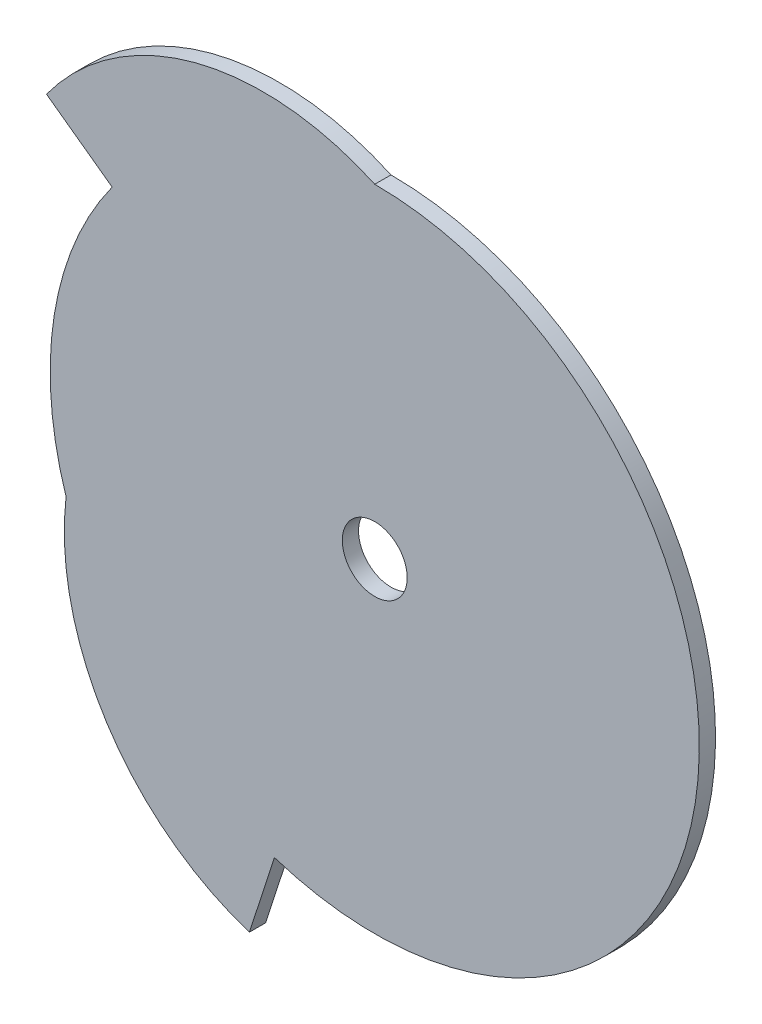
ISO-10303-21;
HEADER;
FILE_DESCRIPTION(('STEP AP214'),'2;1');
FILE_NAME('part.step','',(''),(''),'','','');
FILE_SCHEMA(('AUTOMOTIVE_DESIGN { 1 0 10303 214 1 1 1 1 }'));
ENDSEC;
DATA;
#1=APPLICATION_CONTEXT('core data for automotive mechanical design processes');
#2=APPLICATION_PROTOCOL_DEFINITION('international standard','automotive_design',2000,#1);
#3=PRODUCT_CONTEXT('',#1,'mechanical');
#4=PRODUCT('Part','Part','',(#3));
#5=PRODUCT_RELATED_PRODUCT_CATEGORY('part','',(#4));
#6=PRODUCT_DEFINITION_FORMATION('','',#4);
#7=PRODUCT_DEFINITION_CONTEXT('part definition',#1,'design');
#8=PRODUCT_DEFINITION('design','',#6,#7);
#9=PRODUCT_DEFINITION_SHAPE('','',#8);
#10=(LENGTH_UNIT() NAMED_UNIT(*) SI_UNIT(.MILLI.,.METRE.));
#11=(NAMED_UNIT(*) PLANE_ANGLE_UNIT() SI_UNIT($,.RADIAN.));
#12=(NAMED_UNIT(*) SI_UNIT($,.STERADIAN.) SOLID_ANGLE_UNIT());
#13=UNCERTAINTY_MEASURE_WITH_UNIT(LENGTH_MEASURE(1.E-05),#10,'distance_accuracy_value','');
#14=(GEOMETRIC_REPRESENTATION_CONTEXT(3) GLOBAL_UNCERTAINTY_ASSIGNED_CONTEXT((#13)) GLOBAL_UNIT_ASSIGNED_CONTEXT((#10,
#11,#12)) REPRESENTATION_CONTEXT('',''));
#15=CARTESIAN_POINT('',(0.,0.,0.));
#16=DIRECTION('',(0.,0.,1.));
#17=DIRECTION('',(1.,0.,0.));
#18=AXIS2_PLACEMENT_3D('',#15,#16,#17);
#19=CARTESIAN_POINT('',(0.,0.,3.));
#20=DIRECTION('',(0.,0.,-1.));
#21=DIRECTION('',(-1.,0.,0.));
#22=AXIS2_PLACEMENT_3D('',#19,#20,#21);
#23=CYLINDRICAL_SURFACE('',#22,60.);
#24=CARTESIAN_POINT('',(0.,0.,0.));
#25=DIRECTION('',(0.,0.,1.));
#26=DIRECTION('',(1.,0.,0.));
#27=AXIS2_PLACEMENT_3D('',#24,#25,#26);
#28=CIRCLE('',#27,60.);
#29=CARTESIAN_POINT('',(-48.5410196624971,35.2671151375481,0.));
#30=VERTEX_POINT('',#29);
#31=CARTESIAN_POINT('',(-57.0633909777091,-18.5410196624971,0.));
#32=VERTEX_POINT('',#31);
#33=EDGE_CURVE('E128',#30,#32,#28,.T.);
#34=ORIENTED_EDGE('',*,*,#33,.T.);
#35=DIRECTION('',(0.,0.,-1.));
#36=VECTOR('',#35,1.);
#37=CARTESIAN_POINT('',(-57.0633909777091,-18.5410196624971,3.));
#38=LINE('',#37,#36);
#39=CARTESIAN_POINT('',(-57.0633909777091,-18.5410196624971,3.));
#40=VERTEX_POINT('',#39);
#41=EDGE_CURVE('E11',#40,#32,#38,.T.);
#42=ORIENTED_EDGE('',*,*,#41,.F.);
#43=CARTESIAN_POINT('',(0.,0.,3.));
#44=DIRECTION('',(0.,0.,1.));
#45=DIRECTION('',(1.,0.,0.));
#46=AXIS2_PLACEMENT_3D('',#43,#44,#45);
#47=CIRCLE('',#46,60.);
#48=CARTESIAN_POINT('',(-48.5410196624971,35.2671151375481,3.));
#49=VERTEX_POINT('',#48);
#50=EDGE_CURVE('E145',#49,#40,#47,.T.);
#51=ORIENTED_EDGE('',*,*,#50,.F.);
#52=DIRECTION('',(0.,0.,-1.));
#53=VECTOR('',#52,1.);
#54=CARTESIAN_POINT('',(-48.5410196624971,35.2671151375481,3.));
#55=LINE('',#54,#53);
#56=EDGE_CURVE('E124',#49,#30,#55,.T.);
#57=ORIENTED_EDGE('',*,*,#56,.T.);
#58=EDGE_LOOP('',(#34,#42,#51,#57));
#59=FACE_BOUND('',#58,.T.);
#60=ADVANCED_FACE('F39',(#59),#23,.T.);
#61=CARTESIAN_POINT('',(-7.87457814572885,-24.2354595213106,3.));
#62=DIRECTION('',(0.,0.,-1.));
#63=DIRECTION('',(-1.,0.,0.));
#64=AXIS2_PLACEMENT_3D('',#61,#62,#63);
#65=CYLINDRICAL_SURFACE('',#64,49.5173298262864);
#66=CARTESIAN_POINT('',(-7.87457814572885,-24.2354595213106,0.));
#67=DIRECTION('',(0.,0.,1.));
#68=DIRECTION('',(-1.,0.,0.));
#69=AXIS2_PLACEMENT_3D('',#66,#67,#68);
#70=CIRCLE('',#69,49.5173298262864);
#71=CARTESIAN_POINT('',(-23.1762745781203,-71.3292387221368,0.));
#72=VERTEX_POINT('',#71);
#73=EDGE_CURVE('E132',#32,#72,#70,.T.);
#74=ORIENTED_EDGE('',*,*,#73,.T.);
#75=DIRECTION('',(0.,0.,-1.));
#76=VECTOR('',#75,1.);
#77=CARTESIAN_POINT('',(-23.1762745781203,-71.3292387221368,3.));
#78=LINE('',#77,#76);
#79=CARTESIAN_POINT('',(-23.1762745781203,-71.3292387221368,3.));
#80=VERTEX_POINT('',#79);
#81=EDGE_CURVE('E48',#80,#72,#78,.T.);
#82=ORIENTED_EDGE('',*,*,#81,.F.);
#83=CARTESIAN_POINT('',(-7.87457814572885,-24.2354595213106,3.));
#84=DIRECTION('',(0.,0.,1.));
#85=DIRECTION('',(-1.,0.,0.));
#86=AXIS2_PLACEMENT_3D('',#83,#84,#85);
#87=CIRCLE('',#86,49.5173298262864);
#88=EDGE_CURVE('E93',#40,#80,#87,.T.);
#89=ORIENTED_EDGE('',*,*,#88,.F.);
#90=ORIENTED_EDGE('',*,*,#41,.T.);
#91=EDGE_LOOP('',(#74,#82,#89,#90));
#92=FACE_BOUND('',#91,.T.);
#93=ADVANCED_FACE('F174',(#92),#65,.T.);
#94=CARTESIAN_POINT('',(-18.5410196624963,-57.0633909777094,3.));
#95=DIRECTION('',(-0.951056516295157,0.309016994374938,0.));
#96=DIRECTION('',(-0.309016994374938,-0.951056516295157,0.));
#97=AXIS2_PLACEMENT_3D('',#94,#95,#96);
#98=PLANE('',#97);
#99=DIRECTION('',(0.309016994374938,0.951056516295157,0.));
#100=VECTOR('',#99,1.);
#101=CARTESIAN_POINT('',(-18.5410196624963,-57.0633909777094,0.));
#102=LINE('',#101,#100);
#103=CARTESIAN_POINT('',(-18.5410196624962,-57.0633909777094,0.));
#104=VERTEX_POINT('',#103);
#105=EDGE_CURVE('E136',#72,#104,#102,.T.);
#106=ORIENTED_EDGE('',*,*,#105,.T.);
#107=DIRECTION('',(0.,0.,-1.));
#108=VECTOR('',#107,1.);
#109=CARTESIAN_POINT('',(-18.5410196624962,-57.0633909777094,3.));
#110=LINE('',#109,#108);
#111=CARTESIAN_POINT('',(-18.5410196624962,-57.0633909777094,3.));
#112=VERTEX_POINT('',#111);
#113=EDGE_CURVE('E117',#112,#104,#110,.T.);
#114=ORIENTED_EDGE('',*,*,#113,.F.);
#115=DIRECTION('',(0.309016994374938,0.951056516295157,0.));
#116=VECTOR('',#115,1.);
#117=CARTESIAN_POINT('',(-18.5410196624963,-57.0633909777094,3.));
#118=LINE('',#117,#116);
#119=EDGE_CURVE('E106',#80,#112,#118,.T.);
#120=ORIENTED_EDGE('',*,*,#119,.F.);
#121=ORIENTED_EDGE('',*,*,#81,.T.);
#122=EDGE_LOOP('',(#106,#114,#120,#121));
#123=FACE_BOUND('',#122,.T.);
#124=ADVANCED_FACE('F155',(#123),#98,.F.);
#125=CARTESIAN_POINT('',(0.,0.,3.));
#126=DIRECTION('',(0.,0.,-1.));
#127=DIRECTION('',(-1.,0.,0.));
#128=AXIS2_PLACEMENT_3D('',#125,#126,#127);
#129=CYLINDRICAL_SURFACE('',#128,60.);
#130=CARTESIAN_POINT('',(0.,0.,0.));
#131=DIRECTION('',(0.,0.,1.));
#132=DIRECTION('',(1.,0.,0.));
#133=AXIS2_PLACEMENT_3D('',#130,#131,#132);
#134=CIRCLE('',#133,60.);
#135=CARTESIAN_POINT('',(0.,60.,0.));
#136=VERTEX_POINT('',#135);
#137=EDGE_CURVE('E115',#104,#136,#134,.T.);
#138=ORIENTED_EDGE('',*,*,#137,.T.);
#139=DIRECTION('',(0.,0.,-1.));
#140=VECTOR('',#139,1.);
#141=CARTESIAN_POINT('',(0.,60.,3.));
#142=LINE('',#141,#140);
#143=CARTESIAN_POINT('',(0.,60.,3.));
#144=VERTEX_POINT('',#143);
#145=EDGE_CURVE('E112',#144,#136,#142,.T.);
#146=ORIENTED_EDGE('',*,*,#145,.F.);
#147=CARTESIAN_POINT('',(0.,0.,3.));
#148=DIRECTION('',(0.,0.,1.));
#149=DIRECTION('',(1.,0.,0.));
#150=AXIS2_PLACEMENT_3D('',#147,#148,#149);
#151=CIRCLE('',#150,60.);
#152=EDGE_CURVE('E100',#112,#144,#151,.T.);
#153=ORIENTED_EDGE('',*,*,#152,.F.);
#154=ORIENTED_EDGE('',*,*,#113,.T.);
#155=EDGE_LOOP('',(#138,#146,#153,#154));
#156=FACE_BOUND('',#155,.T.);
#157=ADVANCED_FACE('F113',(#156),#129,.T.);
#158=CARTESIAN_POINT('',(-20.615913232586,14.978337717142,3.));
#159=DIRECTION('',(0.,0.,-1.));
#160=DIRECTION('',(-1.,0.,0.));
#161=AXIS2_PLACEMENT_3D('',#158,#159,#160);
#162=CYLINDRICAL_SURFACE('',#161,49.5173298262864);
#163=CARTESIAN_POINT('',(-20.615913232586,14.978337717142,0.));
#164=DIRECTION('',(0.,0.,1.));
#165=DIRECTION('',(-1.,0.,0.));
#166=AXIS2_PLACEMENT_3D('',#163,#164,#165);
#167=CIRCLE('',#166,49.5173298262864);
#168=CARTESIAN_POINT('',(-60.6762745781213,44.0838939219351,0.));
#169=VERTEX_POINT('',#168);
#170=EDGE_CURVE('E79',#136,#169,#167,.T.);
#171=ORIENTED_EDGE('',*,*,#170,.T.);
#172=DIRECTION('',(0.,0.,-1.));
#173=VECTOR('',#172,1.);
#174=CARTESIAN_POINT('',(-60.6762745781213,44.0838939219351,3.));
#175=LINE('',#174,#173);
#176=CARTESIAN_POINT('',(-60.6762745781213,44.0838939219351,3.));
#177=VERTEX_POINT('',#176);
#178=EDGE_CURVE('E118',#177,#169,#175,.T.);
#179=ORIENTED_EDGE('',*,*,#178,.F.);
#180=CARTESIAN_POINT('',(-20.615913232586,14.978337717142,3.));
#181=DIRECTION('',(0.,0.,1.));
#182=DIRECTION('',(-1.,0.,0.));
#183=AXIS2_PLACEMENT_3D('',#180,#181,#182);
#184=CIRCLE('',#183,49.5173298262864);
#185=EDGE_CURVE('E104',#144,#177,#184,.T.);
#186=ORIENTED_EDGE('',*,*,#185,.F.);
#187=ORIENTED_EDGE('',*,*,#145,.T.);
#188=EDGE_LOOP('',(#171,#179,#186,#187));
#189=FACE_BOUND('',#188,.T.);
#190=ADVANCED_FACE('F120',(#189),#162,.T.);
#191=CARTESIAN_POINT('',(-48.5410196624971,35.2671151375481,3.));
#192=DIRECTION('',(0.587785252292468,0.809016994374951,0.));
#193=DIRECTION('',(-0.809016994374951,0.587785252292468,0.));
#194=AXIS2_PLACEMENT_3D('',#191,#192,#193);
#195=PLANE('',#194);
#196=DIRECTION('',(0.809016994374951,-0.587785252292468,0.));
#197=VECTOR('',#196,1.);
#198=CARTESIAN_POINT('',(-48.5410196624971,35.2671151375481,0.));
#199=LINE('',#198,#197);
#200=EDGE_CURVE('E85',#169,#30,#199,.T.);
#201=ORIENTED_EDGE('',*,*,#200,.T.);
#202=ORIENTED_EDGE('',*,*,#56,.F.);
#203=DIRECTION('',(0.809016994374951,-0.587785252292468,0.));
#204=VECTOR('',#203,1.);
#205=CARTESIAN_POINT('',(-48.5410196624971,35.2671151375481,3.));
#206=LINE('',#205,#204);
#207=EDGE_CURVE('E56',#177,#49,#206,.T.);
#208=ORIENTED_EDGE('',*,*,#207,.F.);
#209=ORIENTED_EDGE('',*,*,#178,.T.);
#210=EDGE_LOOP('',(#201,#202,#208,#209));
#211=FACE_BOUND('',#210,.T.);
#212=ADVANCED_FACE('F162',(#211),#195,.F.);
#213=CARTESIAN_POINT('',(0.,0.,3.));
#214=DIRECTION('',(0.,0.,1.));
#215=DIRECTION('',(1.,0.,0.));
#216=AXIS2_PLACEMENT_3D('',#213,#214,#215);
#217=PLANE('',#216);
#218=CARTESIAN_POINT('',(0.,0.,3.));
#219=DIRECTION('',(0.,0.,1.));
#220=DIRECTION('',(1.,0.,0.));
#221=AXIS2_PLACEMENT_3D('',#218,#219,#220);
#222=CIRCLE('',#221,6.);
#223=CARTESIAN_POINT('',(6.,0.,3.));
#224=VERTEX_POINT('',#223);
#225=EDGE_CURVE('E229',#224,#224,#222,.T.);
#226=ORIENTED_EDGE('',*,*,#225,.F.);
#227=EDGE_LOOP('',(#226));
#228=FACE_BOUND('',#227,.T.);
#229=ORIENTED_EDGE('',*,*,#50,.T.);
#230=ORIENTED_EDGE('',*,*,#88,.T.);
#231=ORIENTED_EDGE('',*,*,#119,.T.);
#232=ORIENTED_EDGE('',*,*,#152,.T.);
#233=ORIENTED_EDGE('',*,*,#185,.T.);
#234=ORIENTED_EDGE('',*,*,#207,.T.);
#235=EDGE_LOOP('',(#229,#230,#231,#232,#233,#234));
#236=FACE_BOUND('',#235,.T.);
#237=ADVANCED_FACE('F102',(#228,#236),#217,.T.);
#238=CARTESIAN_POINT('',(0.,0.,0.));
#239=DIRECTION('',(0.,0.,1.));
#240=DIRECTION('',(1.,0.,0.));
#241=AXIS2_PLACEMENT_3D('',#238,#239,#240);
#242=PLANE('',#241);
#243=CARTESIAN_POINT('',(0.,0.,0.));
#244=DIRECTION('',(0.,0.,1.));
#245=DIRECTION('',(1.,0.,0.));
#246=AXIS2_PLACEMENT_3D('',#243,#244,#245);
#247=CIRCLE('',#246,6.);
#248=CARTESIAN_POINT('',(6.,0.,0.));
#249=VERTEX_POINT('',#248);
#250=EDGE_CURVE('E133',#249,#249,#247,.T.);
#251=ORIENTED_EDGE('',*,*,#250,.T.);
#252=EDGE_LOOP('',(#251));
#253=FACE_BOUND('',#252,.T.);
#254=ORIENTED_EDGE('',*,*,#33,.F.);
#255=ORIENTED_EDGE('',*,*,#200,.F.);
#256=ORIENTED_EDGE('',*,*,#170,.F.);
#257=ORIENTED_EDGE('',*,*,#137,.F.);
#258=ORIENTED_EDGE('',*,*,#105,.F.);
#259=ORIENTED_EDGE('',*,*,#73,.F.);
#260=EDGE_LOOP('',(#254,#255,#256,#257,#258,#259));
#261=FACE_BOUND('',#260,.T.);
#262=ADVANCED_FACE('F158',(#253,#261),#242,.F.);
#263=CARTESIAN_POINT('',(0.,0.,0.));
#264=DIRECTION('',(0.,0.,1.));
#265=DIRECTION('',(1.,0.,0.));
#266=AXIS2_PLACEMENT_3D('',#263,#264,#265);
#267=CYLINDRICAL_SURFACE('',#266,6.);
#268=ORIENTED_EDGE('',*,*,#250,.F.);
#269=EDGE_LOOP('',(#268));
#270=FACE_BOUND('',#269,.T.);
#271=ORIENTED_EDGE('',*,*,#225,.T.);
#272=EDGE_LOOP('',(#271));
#273=FACE_BOUND('',#272,.T.);
#274=ADVANCED_FACE('F211',(#270,#273),#267,.F.);
#275=CLOSED_SHELL('',(#60,#93,#124,#157,#190,#212,#237,#262,#274));
#276=MANIFOLD_SOLID_BREP('B2',#275);
#277=ADVANCED_BREP_SHAPE_REPRESENTATION('',(#18,#276),#14);
#278=SHAPE_DEFINITION_REPRESENTATION(#9,#277);
ENDSEC;
END-ISO-10303-21;
